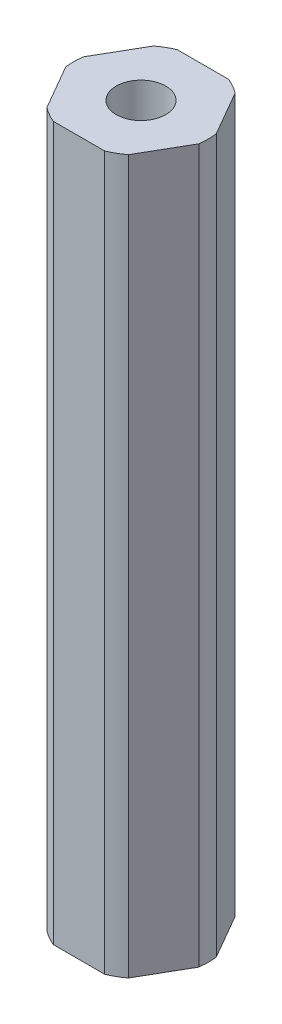
ISO-10303-21;
HEADER;
FILE_DESCRIPTION(('STEP AP214'),'2;1');
FILE_NAME('part.step','',(''),(''),'','','');
FILE_SCHEMA(('AUTOMOTIVE_DESIGN { 1 0 10303 214 1 1 1 1 }'));
ENDSEC;
DATA;
#1=APPLICATION_CONTEXT('core data for automotive mechanical design processes');
#2=APPLICATION_PROTOCOL_DEFINITION('international standard','automotive_design',2000,#1);
#3=PRODUCT_CONTEXT('',#1,'mechanical');
#4=PRODUCT('Part','Part','',(#3));
#5=PRODUCT_RELATED_PRODUCT_CATEGORY('part','',(#4));
#6=PRODUCT_DEFINITION_FORMATION('','',#4);
#7=PRODUCT_DEFINITION_CONTEXT('part definition',#1,'design');
#8=PRODUCT_DEFINITION('design','',#6,#7);
#9=PRODUCT_DEFINITION_SHAPE('','',#8);
#10=(LENGTH_UNIT() NAMED_UNIT(*) SI_UNIT(.MILLI.,.METRE.));
#11=(NAMED_UNIT(*) PLANE_ANGLE_UNIT() SI_UNIT($,.RADIAN.));
#12=(NAMED_UNIT(*) SI_UNIT($,.STERADIAN.) SOLID_ANGLE_UNIT());
#13=UNCERTAINTY_MEASURE_WITH_UNIT(LENGTH_MEASURE(1.E-05),#10,'distance_accuracy_value','');
#14=(GEOMETRIC_REPRESENTATION_CONTEXT(3) GLOBAL_UNCERTAINTY_ASSIGNED_CONTEXT((#13)) GLOBAL_UNIT_ASSIGNED_CONTEXT((#10,
#11,#12)) REPRESENTATION_CONTEXT('',''));
#15=CARTESIAN_POINT('',(0.,0.,0.));
#16=DIRECTION('',(0.,0.,1.));
#17=DIRECTION('',(1.,0.,0.));
#18=AXIS2_PLACEMENT_3D('',#15,#16,#17);
#19=CARTESIAN_POINT('',(0.,73.025,0.));
#20=DIRECTION('',(0.,1.,0.));
#21=DIRECTION('',(0.,0.,1.));
#22=AXIS2_PLACEMENT_3D('',#19,#20,#21);
#23=PLANE('',#22);
#24=CARTESIAN_POINT('',(0.,73.025,0.));
#25=DIRECTION('',(0.,1.,0.));
#26=DIRECTION('',(0.,0.,1.));
#27=AXIS2_PLACEMENT_3D('',#24,#25,#26);
#28=CIRCLE('',#27,6.875);
#29=CARTESIAN_POINT('',(2.63498102459961,73.025,6.35));
#30=VERTEX_POINT('',#29);
#31=CARTESIAN_POINT('',(4.18177080173138,73.025,5.45696050579321));
#32=VERTEX_POINT('',#31);
#33=EDGE_CURVE('E178',#30,#32,#28,.T.);
#34=ORIENTED_EDGE('',*,*,#33,.T.);
#35=DIRECTION('',(0.5,0.,-0.866025403784439));
#36=VECTOR('',#35,1.);
#37=CARTESIAN_POINT('',(4.18177080173138,73.025,5.45696050579321));
#38=LINE('',#37,#36);
#39=CARTESIAN_POINT('',(6.81675182633099,73.025,0.893039494206785));
#40=VERTEX_POINT('',#39);
#41=EDGE_CURVE('E106',#32,#40,#38,.T.);
#42=ORIENTED_EDGE('',*,*,#41,.T.);
#43=CARTESIAN_POINT('',(0.,73.025,0.));
#44=DIRECTION('',(0.,1.,0.));
#45=DIRECTION('',(0.,0.,1.));
#46=AXIS2_PLACEMENT_3D('',#43,#44,#45);
#47=CIRCLE('',#46,6.875);
#48=CARTESIAN_POINT('',(6.81675182633099,73.025,-0.893039494206791));
#49=VERTEX_POINT('',#48);
#50=EDGE_CURVE('E205',#40,#49,#47,.T.);
#51=ORIENTED_EDGE('',*,*,#50,.T.);
#52=DIRECTION('',(-0.5,0.,-0.866025403784438));
#53=VECTOR('',#52,1.);
#54=CARTESIAN_POINT('',(6.81675182633099,73.025,-0.893039494206792));
#55=LINE('',#54,#53);
#56=CARTESIAN_POINT('',(4.18177080173138,73.025,-5.45696050579321));
#57=VERTEX_POINT('',#56);
#58=EDGE_CURVE('E224',#49,#57,#55,.T.);
#59=ORIENTED_EDGE('',*,*,#58,.T.);
#60=CARTESIAN_POINT('',(0.,73.025,0.));
#61=DIRECTION('',(0.,1.,0.));
#62=DIRECTION('',(0.,0.,1.));
#63=AXIS2_PLACEMENT_3D('',#60,#61,#62);
#64=CIRCLE('',#63,6.875);
#65=CARTESIAN_POINT('',(2.63498102459961,73.025,-6.35));
#66=VERTEX_POINT('',#65);
#67=EDGE_CURVE('E221',#57,#66,#64,.T.);
#68=ORIENTED_EDGE('',*,*,#67,.T.);
#69=DIRECTION('',(-1.,0.,0.));
#70=VECTOR('',#69,1.);
#71=CARTESIAN_POINT('',(2.63498102459961,73.025,-6.35));
#72=LINE('',#71,#70);
#73=CARTESIAN_POINT('',(-2.63498102459961,73.025,-6.35));
#74=VERTEX_POINT('',#73);
#75=EDGE_CURVE('E223',#66,#74,#72,.T.);
#76=ORIENTED_EDGE('',*,*,#75,.T.);
#77=CARTESIAN_POINT('',(0.,73.025,0.));
#78=DIRECTION('',(0.,1.,0.));
#79=DIRECTION('',(0.,0.,1.));
#80=AXIS2_PLACEMENT_3D('',#77,#78,#79);
#81=CIRCLE('',#80,6.875);
#82=CARTESIAN_POINT('',(-4.18177080173138,73.025,-5.45696050579321));
#83=VERTEX_POINT('',#82);
#84=EDGE_CURVE('E226',#74,#83,#81,.T.);
#85=ORIENTED_EDGE('',*,*,#84,.T.);
#86=DIRECTION('',(-0.5,0.,0.866025403784439));
#87=VECTOR('',#86,1.);
#88=CARTESIAN_POINT('',(-4.18177080173138,73.025,-5.45696050579321));
#89=LINE('',#88,#87);
#90=CARTESIAN_POINT('',(-6.81675182633099,73.025,-0.893039494206784));
#91=VERTEX_POINT('',#90);
#92=EDGE_CURVE('E232',#83,#91,#89,.T.);
#93=ORIENTED_EDGE('',*,*,#92,.T.);
#94=CARTESIAN_POINT('',(0.,73.025,0.));
#95=DIRECTION('',(0.,1.,0.));
#96=DIRECTION('',(0.,0.,1.));
#97=AXIS2_PLACEMENT_3D('',#94,#95,#96);
#98=CIRCLE('',#97,6.875);
#99=CARTESIAN_POINT('',(-6.81675182633099,73.025,0.893039494206785));
#100=VERTEX_POINT('',#99);
#101=EDGE_CURVE('E137',#91,#100,#98,.T.);
#102=ORIENTED_EDGE('',*,*,#101,.T.);
#103=DIRECTION('',(0.5,0.,0.866025403784438));
#104=VECTOR('',#103,1.);
#105=CARTESIAN_POINT('',(-6.81675182633099,73.025,0.893039494206786));
#106=LINE('',#105,#104);
#107=CARTESIAN_POINT('',(-4.18177080173137,73.025,5.45696050579321));
#108=VERTEX_POINT('',#107);
#109=EDGE_CURVE('E131',#100,#108,#106,.T.);
#110=ORIENTED_EDGE('',*,*,#109,.T.);
#111=CARTESIAN_POINT('',(0.,73.025,0.));
#112=DIRECTION('',(0.,1.,0.));
#113=DIRECTION('',(0.,0.,1.));
#114=AXIS2_PLACEMENT_3D('',#111,#112,#113);
#115=CIRCLE('',#114,6.875);
#116=CARTESIAN_POINT('',(-2.63498102459961,73.025,6.35));
#117=VERTEX_POINT('',#116);
#118=EDGE_CURVE('E135',#108,#117,#115,.T.);
#119=ORIENTED_EDGE('',*,*,#118,.T.);
#120=DIRECTION('',(1.,0.,0.));
#121=VECTOR('',#120,1.);
#122=CARTESIAN_POINT('',(-2.63498102459961,73.025,6.35));
#123=LINE('',#122,#121);
#124=EDGE_CURVE('E51',#117,#30,#123,.T.);
#125=ORIENTED_EDGE('',*,*,#124,.T.);
#126=EDGE_LOOP('',(#34,#42,#51,#59,#68,#76,#85,#93,#102,#110,#119,#125));
#127=FACE_BOUND('',#126,.T.);
#128=CARTESIAN_POINT('',(0.,73.025,0.));
#129=DIRECTION('',(0.,1.,0.));
#130=DIRECTION('',(0.,0.,1.));
#131=AXIS2_PLACEMENT_3D('',#128,#129,#130);
#132=CIRCLE('',#131,2.54);
#133=CARTESIAN_POINT('',(0.,73.025,2.54));
#134=VERTEX_POINT('',#133);
#135=EDGE_CURVE('E159',#134,#134,#132,.T.);
#136=ORIENTED_EDGE('',*,*,#135,.F.);
#137=EDGE_LOOP('',(#136));
#138=FACE_BOUND('',#137,.T.);
#139=ADVANCED_FACE('F34',(#127,#138),#23,.T.);
#140=CARTESIAN_POINT('',(0.,0.,0.));
#141=DIRECTION('',(0.,1.,0.));
#142=DIRECTION('',(0.,0.,1.));
#143=AXIS2_PLACEMENT_3D('',#140,#141,#142);
#144=PLANE('',#143);
#145=CARTESIAN_POINT('',(0.,0.,0.));
#146=DIRECTION('',(0.,1.,0.));
#147=DIRECTION('',(0.,0.,1.));
#148=AXIS2_PLACEMENT_3D('',#145,#146,#147);
#149=CIRCLE('',#148,6.875);
#150=CARTESIAN_POINT('',(2.63498102459961,0.,6.35));
#151=VERTEX_POINT('',#150);
#152=CARTESIAN_POINT('',(4.18177080173138,0.,5.45696050579321));
#153=VERTEX_POINT('',#152);
#154=EDGE_CURVE('E155',#151,#153,#149,.T.);
#155=ORIENTED_EDGE('',*,*,#154,.F.);
#156=DIRECTION('',(1.,0.,0.));
#157=VECTOR('',#156,1.);
#158=CARTESIAN_POINT('',(-2.63498102459961,0.,6.35));
#159=LINE('',#158,#157);
#160=CARTESIAN_POINT('',(-2.63498102459961,0.,6.35));
#161=VERTEX_POINT('',#160);
#162=EDGE_CURVE('E98',#161,#151,#159,.T.);
#163=ORIENTED_EDGE('',*,*,#162,.F.);
#164=CARTESIAN_POINT('',(0.,0.,0.));
#165=DIRECTION('',(0.,1.,0.));
#166=DIRECTION('',(0.,0.,1.));
#167=AXIS2_PLACEMENT_3D('',#164,#165,#166);
#168=CIRCLE('',#167,6.875);
#169=CARTESIAN_POINT('',(-4.18177080173137,0.,5.45696050579321));
#170=VERTEX_POINT('',#169);
#171=EDGE_CURVE('E92',#170,#161,#168,.T.);
#172=ORIENTED_EDGE('',*,*,#171,.F.);
#173=DIRECTION('',(0.5,0.,0.866025403784438));
#174=VECTOR('',#173,1.);
#175=CARTESIAN_POINT('',(-6.81675182633099,0.,0.893039494206786));
#176=LINE('',#175,#174);
#177=CARTESIAN_POINT('',(-6.81675182633099,0.,0.893039494206785));
#178=VERTEX_POINT('',#177);
#179=EDGE_CURVE('E145',#178,#170,#176,.T.);
#180=ORIENTED_EDGE('',*,*,#179,.F.);
#181=CARTESIAN_POINT('',(0.,0.,0.));
#182=DIRECTION('',(0.,1.,0.));
#183=DIRECTION('',(0.,0.,1.));
#184=AXIS2_PLACEMENT_3D('',#181,#182,#183);
#185=CIRCLE('',#184,6.875);
#186=CARTESIAN_POINT('',(-6.81675182633099,0.,-0.893039494206784));
#187=VERTEX_POINT('',#186);
#188=EDGE_CURVE('E173',#187,#178,#185,.T.);
#189=ORIENTED_EDGE('',*,*,#188,.F.);
#190=DIRECTION('',(-0.5,0.,0.866025403784439));
#191=VECTOR('',#190,1.);
#192=CARTESIAN_POINT('',(-4.18177080173138,0.,-5.45696050579321));
#193=LINE('',#192,#191);
#194=CARTESIAN_POINT('',(-4.18177080173138,0.,-5.45696050579321));
#195=VERTEX_POINT('',#194);
#196=EDGE_CURVE('E171',#195,#187,#193,.T.);
#197=ORIENTED_EDGE('',*,*,#196,.F.);
#198=CARTESIAN_POINT('',(0.,0.,0.));
#199=DIRECTION('',(0.,1.,0.));
#200=DIRECTION('',(0.,0.,1.));
#201=AXIS2_PLACEMENT_3D('',#198,#199,#200);
#202=CIRCLE('',#201,6.875);
#203=CARTESIAN_POINT('',(-2.63498102459961,0.,-6.35));
#204=VERTEX_POINT('',#203);
#205=EDGE_CURVE('E169',#204,#195,#202,.T.);
#206=ORIENTED_EDGE('',*,*,#205,.F.);
#207=DIRECTION('',(-1.,0.,0.));
#208=VECTOR('',#207,1.);
#209=CARTESIAN_POINT('',(2.63498102459961,0.,-6.35));
#210=LINE('',#209,#208);
#211=CARTESIAN_POINT('',(2.63498102459961,0.,-6.35));
#212=VERTEX_POINT('',#211);
#213=EDGE_CURVE('E167',#212,#204,#210,.T.);
#214=ORIENTED_EDGE('',*,*,#213,.F.);
#215=CARTESIAN_POINT('',(0.,0.,0.));
#216=DIRECTION('',(0.,1.,0.));
#217=DIRECTION('',(0.,0.,1.));
#218=AXIS2_PLACEMENT_3D('',#215,#216,#217);
#219=CIRCLE('',#218,6.875);
#220=CARTESIAN_POINT('',(4.18177080173138,0.,-5.45696050579321));
#221=VERTEX_POINT('',#220);
#222=EDGE_CURVE('E165',#221,#212,#219,.T.);
#223=ORIENTED_EDGE('',*,*,#222,.F.);
#224=DIRECTION('',(-0.5,0.,-0.866025403784438));
#225=VECTOR('',#224,1.);
#226=CARTESIAN_POINT('',(6.81675182633099,0.,-0.893039494206792));
#227=LINE('',#226,#225);
#228=CARTESIAN_POINT('',(6.81675182633099,0.,-0.893039494206791));
#229=VERTEX_POINT('',#228);
#230=EDGE_CURVE('E163',#229,#221,#227,.T.);
#231=ORIENTED_EDGE('',*,*,#230,.F.);
#232=CARTESIAN_POINT('',(0.,0.,0.));
#233=DIRECTION('',(0.,1.,0.));
#234=DIRECTION('',(0.,0.,1.));
#235=AXIS2_PLACEMENT_3D('',#232,#233,#234);
#236=CIRCLE('',#235,6.875);
#237=CARTESIAN_POINT('',(6.81675182633099,0.,0.893039494206785));
#238=VERTEX_POINT('',#237);
#239=EDGE_CURVE('E161',#238,#229,#236,.T.);
#240=ORIENTED_EDGE('',*,*,#239,.F.);
#241=DIRECTION('',(0.5,0.,-0.866025403784439));
#242=VECTOR('',#241,1.);
#243=CARTESIAN_POINT('',(4.18177080173138,0.,5.45696050579321));
#244=LINE('',#243,#242);
#245=EDGE_CURVE('E158',#153,#238,#244,.T.);
#246=ORIENTED_EDGE('',*,*,#245,.F.);
#247=EDGE_LOOP('',(#155,#163,#172,#180,#189,#197,#206,#214,#223,#231,#240,#246));
#248=FACE_BOUND('',#247,.T.);
#249=CARTESIAN_POINT('',(0.,0.,0.));
#250=DIRECTION('',(0.,1.,0.));
#251=DIRECTION('',(0.,0.,1.));
#252=AXIS2_PLACEMENT_3D('',#249,#250,#251);
#253=CIRCLE('',#252,2.54);
#254=CARTESIAN_POINT('',(0.,0.,2.54));
#255=VERTEX_POINT('',#254);
#256=EDGE_CURVE('E391',#255,#255,#253,.T.);
#257=ORIENTED_EDGE('',*,*,#256,.T.);
#258=EDGE_LOOP('',(#257));
#259=FACE_BOUND('',#258,.T.);
#260=ADVANCED_FACE('F209',(#248,#259),#144,.F.);
#261=CARTESIAN_POINT('',(0.,73.025,0.));
#262=DIRECTION('',(0.,-1.,0.));
#263=DIRECTION('',(0.,0.,-1.));
#264=AXIS2_PLACEMENT_3D('',#261,#262,#263);
#265=CYLINDRICAL_SURFACE('',#264,6.875);
#266=ORIENTED_EDGE('',*,*,#154,.T.);
#267=DIRECTION('',(0.,-1.,0.));
#268=VECTOR('',#267,1.);
#269=CARTESIAN_POINT('',(4.18177080173138,73.025,5.45696050579321));
#270=LINE('',#269,#268);
#271=EDGE_CURVE('E11',#32,#153,#270,.T.);
#272=ORIENTED_EDGE('',*,*,#271,.F.);
#273=ORIENTED_EDGE('',*,*,#33,.F.);
#274=DIRECTION('',(0.,-1.,0.));
#275=VECTOR('',#274,1.);
#276=CARTESIAN_POINT('',(2.63498102459961,73.025,6.35));
#277=LINE('',#276,#275);
#278=EDGE_CURVE('E151',#30,#151,#277,.T.);
#279=ORIENTED_EDGE('',*,*,#278,.T.);
#280=EDGE_LOOP('',(#266,#272,#273,#279));
#281=FACE_BOUND('',#280,.T.);
#282=ADVANCED_FACE('F36',(#281),#265,.T.);
#283=CARTESIAN_POINT('',(4.18177080173138,73.025,5.45696050579321));
#284=DIRECTION('',(-0.866025403784439,0.,-0.5));
#285=DIRECTION('',(-0.5,0.,0.866025403784439));
#286=AXIS2_PLACEMENT_3D('',#283,#284,#285);
#287=PLANE('',#286);
#288=ORIENTED_EDGE('',*,*,#245,.T.);
#289=DIRECTION('',(0.,-1.,0.));
#290=VECTOR('',#289,1.);
#291=CARTESIAN_POINT('',(6.81675182633099,73.025,0.893039494206785));
#292=LINE('',#291,#290);
#293=EDGE_CURVE('E43',#40,#238,#292,.T.);
#294=ORIENTED_EDGE('',*,*,#293,.F.);
#295=ORIENTED_EDGE('',*,*,#41,.F.);
#296=ORIENTED_EDGE('',*,*,#271,.T.);
#297=EDGE_LOOP('',(#288,#294,#295,#296));
#298=FACE_BOUND('',#297,.T.);
#299=ADVANCED_FACE('F266',(#298),#287,.F.);
#300=CARTESIAN_POINT('',(0.,73.025,0.));
#301=DIRECTION('',(0.,-1.,0.));
#302=DIRECTION('',(0.,0.,-1.));
#303=AXIS2_PLACEMENT_3D('',#300,#301,#302);
#304=CYLINDRICAL_SURFACE('',#303,6.875);
#305=ORIENTED_EDGE('',*,*,#239,.T.);
#306=DIRECTION('',(0.,-1.,0.));
#307=VECTOR('',#306,1.);
#308=CARTESIAN_POINT('',(6.81675182633099,73.025,-0.893039494206791));
#309=LINE('',#308,#307);
#310=EDGE_CURVE('E197',#49,#229,#309,.T.);
#311=ORIENTED_EDGE('',*,*,#310,.F.);
#312=ORIENTED_EDGE('',*,*,#50,.F.);
#313=ORIENTED_EDGE('',*,*,#293,.T.);
#314=EDGE_LOOP('',(#305,#311,#312,#313));
#315=FACE_BOUND('',#314,.T.);
#316=ADVANCED_FACE('F203',(#315),#304,.T.);
#317=CARTESIAN_POINT('',(6.81675182633099,73.025,-0.893039494206792));
#318=DIRECTION('',(-0.866025403784439,0.,0.5));
#319=DIRECTION('',(0.5,0.,0.866025403784439));
#320=AXIS2_PLACEMENT_3D('',#317,#318,#319);
#321=PLANE('',#320);
#322=ORIENTED_EDGE('',*,*,#230,.T.);
#323=DIRECTION('',(0.,-1.,0.));
#324=VECTOR('',#323,1.);
#325=CARTESIAN_POINT('',(4.18177080173138,73.025,-5.45696050579321));
#326=LINE('',#325,#324);
#327=EDGE_CURVE('E194',#57,#221,#326,.T.);
#328=ORIENTED_EDGE('',*,*,#327,.F.);
#329=ORIENTED_EDGE('',*,*,#58,.F.);
#330=ORIENTED_EDGE('',*,*,#310,.T.);
#331=EDGE_LOOP('',(#322,#328,#329,#330));
#332=FACE_BOUND('',#331,.T.);
#333=ADVANCED_FACE('F215',(#332),#321,.F.);
#334=CARTESIAN_POINT('',(0.,73.025,0.));
#335=DIRECTION('',(0.,-1.,0.));
#336=DIRECTION('',(0.,0.,-1.));
#337=AXIS2_PLACEMENT_3D('',#334,#335,#336);
#338=CYLINDRICAL_SURFACE('',#337,6.875);
#339=ORIENTED_EDGE('',*,*,#222,.T.);
#340=DIRECTION('',(0.,-1.,0.));
#341=VECTOR('',#340,1.);
#342=CARTESIAN_POINT('',(2.63498102459961,73.025,-6.35));
#343=LINE('',#342,#341);
#344=EDGE_CURVE('E191',#66,#212,#343,.T.);
#345=ORIENTED_EDGE('',*,*,#344,.F.);
#346=ORIENTED_EDGE('',*,*,#67,.F.);
#347=ORIENTED_EDGE('',*,*,#327,.T.);
#348=EDGE_LOOP('',(#339,#345,#346,#347));
#349=FACE_BOUND('',#348,.T.);
#350=ADVANCED_FACE('F219',(#349),#338,.T.);
#351=CARTESIAN_POINT('',(2.63498102459961,73.025,-6.35));
#352=DIRECTION('',(0.,0.,1.));
#353=DIRECTION('',(1.,0.,0.));
#354=AXIS2_PLACEMENT_3D('',#351,#352,#353);
#355=PLANE('',#354);
#356=ORIENTED_EDGE('',*,*,#213,.T.);
#357=DIRECTION('',(0.,-1.,0.));
#358=VECTOR('',#357,1.);
#359=CARTESIAN_POINT('',(-2.63498102459961,73.025,-6.35));
#360=LINE('',#359,#358);
#361=EDGE_CURVE('E188',#74,#204,#360,.T.);
#362=ORIENTED_EDGE('',*,*,#361,.F.);
#363=ORIENTED_EDGE('',*,*,#75,.F.);
#364=ORIENTED_EDGE('',*,*,#344,.T.);
#365=EDGE_LOOP('',(#356,#362,#363,#364));
#366=FACE_BOUND('',#365,.T.);
#367=ADVANCED_FACE('F279',(#366),#355,.F.);
#368=CARTESIAN_POINT('',(0.,73.025,0.));
#369=DIRECTION('',(0.,-1.,0.));
#370=DIRECTION('',(0.,0.,-1.));
#371=AXIS2_PLACEMENT_3D('',#368,#369,#370);
#372=CYLINDRICAL_SURFACE('',#371,6.875);
#373=ORIENTED_EDGE('',*,*,#205,.T.);
#374=DIRECTION('',(0.,-1.,0.));
#375=VECTOR('',#374,1.);
#376=CARTESIAN_POINT('',(-4.18177080173138,73.025,-5.45696050579321));
#377=LINE('',#376,#375);
#378=EDGE_CURVE('E185',#83,#195,#377,.T.);
#379=ORIENTED_EDGE('',*,*,#378,.F.);
#380=ORIENTED_EDGE('',*,*,#84,.F.);
#381=ORIENTED_EDGE('',*,*,#361,.T.);
#382=EDGE_LOOP('',(#373,#379,#380,#381));
#383=FACE_BOUND('',#382,.T.);
#384=ADVANCED_FACE('F282',(#383),#372,.T.);
#385=CARTESIAN_POINT('',(-4.18177080173138,73.025,-5.45696050579321));
#386=DIRECTION('',(0.866025403784439,0.,0.5));
#387=DIRECTION('',(0.5,0.,-0.866025403784439));
#388=AXIS2_PLACEMENT_3D('',#385,#386,#387);
#389=PLANE('',#388);
#390=ORIENTED_EDGE('',*,*,#196,.T.);
#391=DIRECTION('',(0.,-1.,0.));
#392=VECTOR('',#391,1.);
#393=CARTESIAN_POINT('',(-6.81675182633099,73.025,-0.893039494206784));
#394=LINE('',#393,#392);
#395=EDGE_CURVE('E182',#91,#187,#394,.T.);
#396=ORIENTED_EDGE('',*,*,#395,.F.);
#397=ORIENTED_EDGE('',*,*,#92,.F.);
#398=ORIENTED_EDGE('',*,*,#378,.T.);
#399=EDGE_LOOP('',(#390,#396,#397,#398));
#400=FACE_BOUND('',#399,.T.);
#401=ADVANCED_FACE('F238',(#400),#389,.F.);
#402=CARTESIAN_POINT('',(0.,73.025,0.));
#403=DIRECTION('',(0.,-1.,0.));
#404=DIRECTION('',(0.,0.,-1.));
#405=AXIS2_PLACEMENT_3D('',#402,#403,#404);
#406=CYLINDRICAL_SURFACE('',#405,6.875);
#407=ORIENTED_EDGE('',*,*,#188,.T.);
#408=DIRECTION('',(0.,-1.,0.));
#409=VECTOR('',#408,1.);
#410=CARTESIAN_POINT('',(-6.81675182633099,73.025,0.893039494206785));
#411=LINE('',#410,#409);
#412=EDGE_CURVE('E146',#100,#178,#411,.T.);
#413=ORIENTED_EDGE('',*,*,#412,.F.);
#414=ORIENTED_EDGE('',*,*,#101,.F.);
#415=ORIENTED_EDGE('',*,*,#395,.T.);
#416=EDGE_LOOP('',(#407,#413,#414,#415));
#417=FACE_BOUND('',#416,.T.);
#418=ADVANCED_FACE('F242',(#417),#406,.T.);
#419=CARTESIAN_POINT('',(-6.81675182633099,73.025,0.893039494206786));
#420=DIRECTION('',(0.866025403784439,0.,-0.5));
#421=DIRECTION('',(-0.5,0.,-0.866025403784439));
#422=AXIS2_PLACEMENT_3D('',#419,#420,#421);
#423=PLANE('',#422);
#424=ORIENTED_EDGE('',*,*,#179,.T.);
#425=DIRECTION('',(0.,-1.,0.));
#426=VECTOR('',#425,1.);
#427=CARTESIAN_POINT('',(-4.18177080173137,73.025,5.45696050579321));
#428=LINE('',#427,#426);
#429=EDGE_CURVE('E142',#108,#170,#428,.T.);
#430=ORIENTED_EDGE('',*,*,#429,.F.);
#431=ORIENTED_EDGE('',*,*,#109,.F.);
#432=ORIENTED_EDGE('',*,*,#412,.T.);
#433=EDGE_LOOP('',(#424,#430,#431,#432));
#434=FACE_BOUND('',#433,.T.);
#435=ADVANCED_FACE('F143',(#434),#423,.F.);
#436=CARTESIAN_POINT('',(0.,73.025,0.));
#437=DIRECTION('',(0.,-1.,0.));
#438=DIRECTION('',(0.,0.,-1.));
#439=AXIS2_PLACEMENT_3D('',#436,#437,#438);
#440=CYLINDRICAL_SURFACE('',#439,6.875);
#441=ORIENTED_EDGE('',*,*,#171,.T.);
#442=DIRECTION('',(0.,-1.,0.));
#443=VECTOR('',#442,1.);
#444=CARTESIAN_POINT('',(-2.63498102459961,73.025,6.35));
#445=LINE('',#444,#443);
#446=EDGE_CURVE('E147',#117,#161,#445,.T.);
#447=ORIENTED_EDGE('',*,*,#446,.F.);
#448=ORIENTED_EDGE('',*,*,#118,.F.);
#449=ORIENTED_EDGE('',*,*,#429,.T.);
#450=EDGE_LOOP('',(#441,#447,#448,#449));
#451=FACE_BOUND('',#450,.T.);
#452=ADVANCED_FACE('F149',(#451),#440,.T.);
#453=CARTESIAN_POINT('',(-2.63498102459961,73.025,6.35));
#454=DIRECTION('',(0.,0.,-1.));
#455=DIRECTION('',(-1.,0.,0.));
#456=AXIS2_PLACEMENT_3D('',#453,#454,#455);
#457=PLANE('',#456);
#458=ORIENTED_EDGE('',*,*,#162,.T.);
#459=ORIENTED_EDGE('',*,*,#278,.F.);
#460=ORIENTED_EDGE('',*,*,#124,.F.);
#461=ORIENTED_EDGE('',*,*,#446,.T.);
#462=EDGE_LOOP('',(#458,#459,#460,#461));
#463=FACE_BOUND('',#462,.T.);
#464=ADVANCED_FACE('F246',(#463),#457,.F.);
#465=CARTESIAN_POINT('',(0.,73.025,0.));
#466=DIRECTION('',(0.,-1.,0.));
#467=DIRECTION('',(0.,0.,-1.));
#468=AXIS2_PLACEMENT_3D('',#465,#466,#467);
#469=CYLINDRICAL_SURFACE('',#468,2.54);
#470=ORIENTED_EDGE('',*,*,#135,.T.);
#471=EDGE_LOOP('',(#470));
#472=FACE_BOUND('',#471,.T.);
#473=ORIENTED_EDGE('',*,*,#256,.F.);
#474=EDGE_LOOP('',(#473));
#475=FACE_BOUND('',#474,.T.);
#476=ADVANCED_FACE('F248',(#472,#475),#469,.F.);
#477=CLOSED_SHELL('',(#139,#260,#282,#299,#316,#333,#350,#367,#384,#401,#418,#435,#452,#464,#476));
#478=MANIFOLD_SOLID_BREP('B2',#477);
#479=ADVANCED_BREP_SHAPE_REPRESENTATION('',(#18,#478),#14);
#480=SHAPE_DEFINITION_REPRESENTATION(#9,#479);
ENDSEC;
END-ISO-10303-21;
